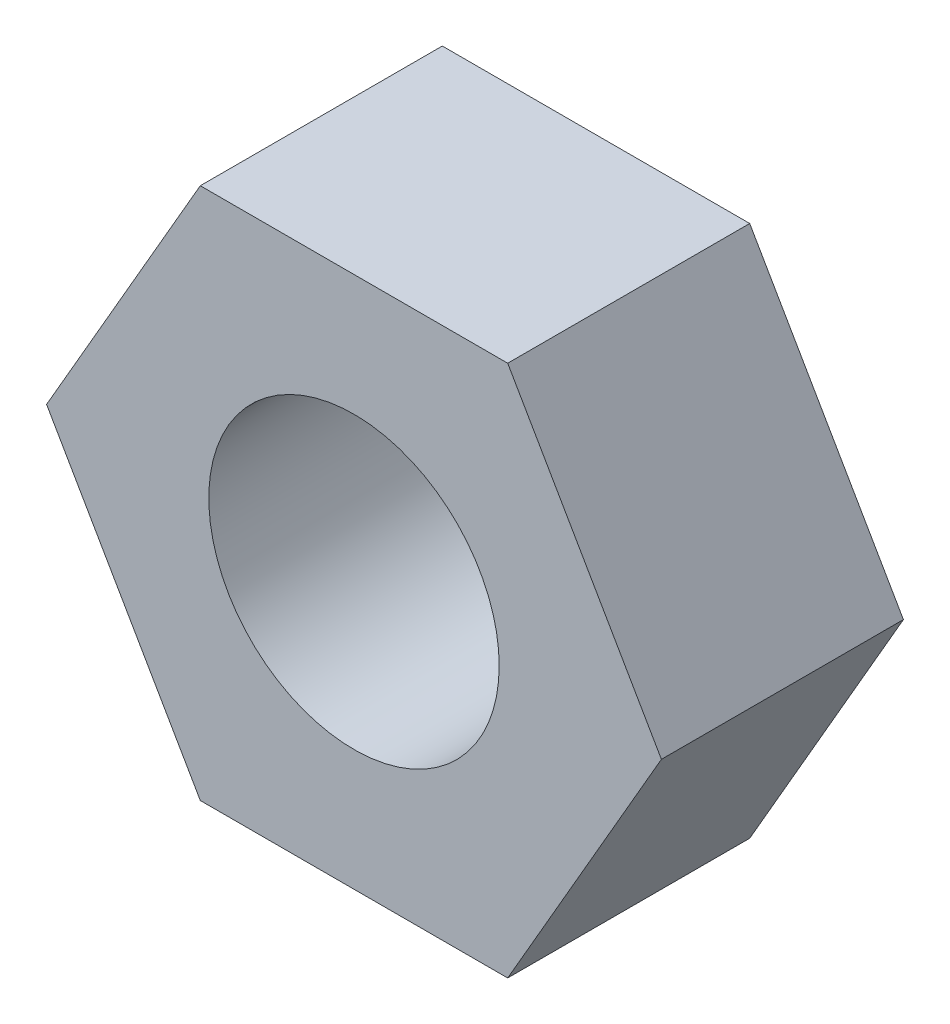
ISO-10303-21;
HEADER;
FILE_DESCRIPTION(('STEP AP214'),'2;1');
FILE_NAME('part.step','',(''),(''),'','','');
FILE_SCHEMA(('AUTOMOTIVE_DESIGN { 1 0 10303 214 1 1 1 1 }'));
ENDSEC;
DATA;
#1=APPLICATION_CONTEXT('core data for automotive mechanical design processes');
#2=APPLICATION_PROTOCOL_DEFINITION('international standard','automotive_design',2000,#1);
#3=PRODUCT_CONTEXT('',#1,'mechanical');
#4=PRODUCT('Part','Part','',(#3));
#5=PRODUCT_RELATED_PRODUCT_CATEGORY('part','',(#4));
#6=PRODUCT_DEFINITION_FORMATION('','',#4);
#7=PRODUCT_DEFINITION_CONTEXT('part definition',#1,'design');
#8=PRODUCT_DEFINITION('design','',#6,#7);
#9=PRODUCT_DEFINITION_SHAPE('','',#8);
#10=(LENGTH_UNIT() NAMED_UNIT(*) SI_UNIT(.MILLI.,.METRE.));
#11=(NAMED_UNIT(*) PLANE_ANGLE_UNIT() SI_UNIT($,.RADIAN.));
#12=(NAMED_UNIT(*) SI_UNIT($,.STERADIAN.) SOLID_ANGLE_UNIT());
#13=UNCERTAINTY_MEASURE_WITH_UNIT(LENGTH_MEASURE(1.E-05),#10,'distance_accuracy_value','');
#14=(GEOMETRIC_REPRESENTATION_CONTEXT(3) GLOBAL_UNCERTAINTY_ASSIGNED_CONTEXT((#13)) GLOBAL_UNIT_ASSIGNED_CONTEXT((#10,
#11,#12)) REPRESENTATION_CONTEXT('',''));
#15=CARTESIAN_POINT('',(0.,0.,0.));
#16=DIRECTION('',(0.,0.,1.));
#17=DIRECTION('',(1.,0.,0.));
#18=AXIS2_PLACEMENT_3D('',#15,#16,#17);
#19=CARTESIAN_POINT('',(3.17542648054294,0.,2.5));
#20=DIRECTION('',(-0.866025403784439,-0.5,0.));
#21=DIRECTION('',(0.5,-0.866025403784439,0.));
#22=AXIS2_PLACEMENT_3D('',#19,#20,#21);
#23=PLANE('',#22);
#24=DIRECTION('',(-0.5,0.866025403784438,0.));
#25=VECTOR('',#24,1.);
#26=CARTESIAN_POINT('',(3.17542648054294,0.,0.));
#27=LINE('',#26,#25);
#28=CARTESIAN_POINT('',(3.17542648054294,0.,0.));
#29=VERTEX_POINT('',#28);
#30=CARTESIAN_POINT('',(1.58771324027147,2.75,0.));
#31=VERTEX_POINT('',#30);
#32=EDGE_CURVE('E128',#29,#31,#27,.T.);
#33=ORIENTED_EDGE('',*,*,#32,.T.);
#34=DIRECTION('',(0.,0.,-1.));
#35=VECTOR('',#34,1.);
#36=CARTESIAN_POINT('',(1.58771324027147,2.75,2.5));
#37=LINE('',#36,#35);
#38=CARTESIAN_POINT('',(1.58771324027147,2.75,2.5));
#39=VERTEX_POINT('',#38);
#40=EDGE_CURVE('E11',#39,#31,#37,.T.);
#41=ORIENTED_EDGE('',*,*,#40,.F.);
#42=DIRECTION('',(-0.5,0.866025403784438,0.));
#43=VECTOR('',#42,1.);
#44=CARTESIAN_POINT('',(3.17542648054294,0.,2.5));
#45=LINE('',#44,#43);
#46=CARTESIAN_POINT('',(3.17542648054294,0.,2.5));
#47=VERTEX_POINT('',#46);
#48=EDGE_CURVE('E145',#47,#39,#45,.T.);
#49=ORIENTED_EDGE('',*,*,#48,.F.);
#50=DIRECTION('',(0.,0.,-1.));
#51=VECTOR('',#50,1.);
#52=CARTESIAN_POINT('',(3.17542648054294,0.,2.5));
#53=LINE('',#52,#51);
#54=EDGE_CURVE('E124',#47,#29,#53,.T.);
#55=ORIENTED_EDGE('',*,*,#54,.T.);
#56=EDGE_LOOP('',(#33,#41,#49,#55));
#57=FACE_BOUND('',#56,.T.);
#58=ADVANCED_FACE('F39',(#57),#23,.F.);
#59=CARTESIAN_POINT('',(1.58771324027147,2.75,2.5));
#60=DIRECTION('',(0.,-1.,0.));
#61=DIRECTION('',(1.,0.,0.));
#62=AXIS2_PLACEMENT_3D('',#59,#60,#61);
#63=PLANE('',#62);
#64=DIRECTION('',(-1.,0.,0.));
#65=VECTOR('',#64,1.);
#66=CARTESIAN_POINT('',(1.58771324027147,2.75,0.));
#67=LINE('',#66,#65);
#68=CARTESIAN_POINT('',(-1.58771324027147,2.75,0.));
#69=VERTEX_POINT('',#68);
#70=EDGE_CURVE('E132',#31,#69,#67,.T.);
#71=ORIENTED_EDGE('',*,*,#70,.T.);
#72=DIRECTION('',(0.,0.,-1.));
#73=VECTOR('',#72,1.);
#74=CARTESIAN_POINT('',(-1.58771324027147,2.75,2.5));
#75=LINE('',#74,#73);
#76=CARTESIAN_POINT('',(-1.58771324027147,2.75,2.5));
#77=VERTEX_POINT('',#76);
#78=EDGE_CURVE('E48',#77,#69,#75,.T.);
#79=ORIENTED_EDGE('',*,*,#78,.F.);
#80=DIRECTION('',(-1.,0.,0.));
#81=VECTOR('',#80,1.);
#82=CARTESIAN_POINT('',(1.58771324027147,2.75,2.5));
#83=LINE('',#82,#81);
#84=EDGE_CURVE('E93',#39,#77,#83,.T.);
#85=ORIENTED_EDGE('',*,*,#84,.F.);
#86=ORIENTED_EDGE('',*,*,#40,.T.);
#87=EDGE_LOOP('',(#71,#79,#85,#86));
#88=FACE_BOUND('',#87,.T.);
#89=ADVANCED_FACE('F174',(#88),#63,.F.);
#90=CARTESIAN_POINT('',(-1.58771324027147,2.75,2.5));
#91=DIRECTION('',(0.866025403784439,-0.5,0.));
#92=DIRECTION('',(0.5,0.866025403784439,0.));
#93=AXIS2_PLACEMENT_3D('',#90,#91,#92);
#94=PLANE('',#93);
#95=DIRECTION('',(-0.5,-0.866025403784439,0.));
#96=VECTOR('',#95,1.);
#97=CARTESIAN_POINT('',(-1.58771324027147,2.75,0.));
#98=LINE('',#97,#96);
#99=CARTESIAN_POINT('',(-3.17542648054294,0.,0.));
#100=VERTEX_POINT('',#99);
#101=EDGE_CURVE('E136',#69,#100,#98,.T.);
#102=ORIENTED_EDGE('',*,*,#101,.T.);
#103=DIRECTION('',(0.,0.,-1.));
#104=VECTOR('',#103,1.);
#105=CARTESIAN_POINT('',(-3.17542648054294,0.,2.5));
#106=LINE('',#105,#104);
#107=CARTESIAN_POINT('',(-3.17542648054294,0.,2.5));
#108=VERTEX_POINT('',#107);
#109=EDGE_CURVE('E117',#108,#100,#106,.T.);
#110=ORIENTED_EDGE('',*,*,#109,.F.);
#111=DIRECTION('',(-0.5,-0.866025403784439,0.));
#112=VECTOR('',#111,1.);
#113=CARTESIAN_POINT('',(-1.58771324027147,2.75,2.5));
#114=LINE('',#113,#112);
#115=EDGE_CURVE('E106',#77,#108,#114,.T.);
#116=ORIENTED_EDGE('',*,*,#115,.F.);
#117=ORIENTED_EDGE('',*,*,#78,.T.);
#118=EDGE_LOOP('',(#102,#110,#116,#117));
#119=FACE_BOUND('',#118,.T.);
#120=ADVANCED_FACE('F155',(#119),#94,.F.);
#121=CARTESIAN_POINT('',(-3.17542648054294,0.,2.5));
#122=DIRECTION('',(0.866025403784439,0.5,0.));
#123=DIRECTION('',(-0.5,0.866025403784439,0.));
#124=AXIS2_PLACEMENT_3D('',#121,#122,#123);
#125=PLANE('',#124);
#126=DIRECTION('',(0.5,-0.866025403784438,0.));
#127=VECTOR('',#126,1.);
#128=CARTESIAN_POINT('',(-3.17542648054294,0.,0.));
#129=LINE('',#128,#127);
#130=CARTESIAN_POINT('',(-1.58771324027147,-2.75,0.));
#131=VERTEX_POINT('',#130);
#132=EDGE_CURVE('E115',#100,#131,#129,.T.);
#133=ORIENTED_EDGE('',*,*,#132,.T.);
#134=DIRECTION('',(0.,0.,-1.));
#135=VECTOR('',#134,1.);
#136=CARTESIAN_POINT('',(-1.58771324027147,-2.75,2.5));
#137=LINE('',#136,#135);
#138=CARTESIAN_POINT('',(-1.58771324027147,-2.75,2.5));
#139=VERTEX_POINT('',#138);
#140=EDGE_CURVE('E112',#139,#131,#137,.T.);
#141=ORIENTED_EDGE('',*,*,#140,.F.);
#142=DIRECTION('',(0.5,-0.866025403784438,0.));
#143=VECTOR('',#142,1.);
#144=CARTESIAN_POINT('',(-3.17542648054294,0.,2.5));
#145=LINE('',#144,#143);
#146=EDGE_CURVE('E100',#108,#139,#145,.T.);
#147=ORIENTED_EDGE('',*,*,#146,.F.);
#148=ORIENTED_EDGE('',*,*,#109,.T.);
#149=EDGE_LOOP('',(#133,#141,#147,#148));
#150=FACE_BOUND('',#149,.T.);
#151=ADVANCED_FACE('F113',(#150),#125,.F.);
#152=CARTESIAN_POINT('',(-1.58771324027147,-2.75,2.5));
#153=DIRECTION('',(0.,1.,0.));
#154=DIRECTION('',(-1.,0.,0.));
#155=AXIS2_PLACEMENT_3D('',#152,#153,#154);
#156=PLANE('',#155);
#157=DIRECTION('',(1.,0.,0.));
#158=VECTOR('',#157,1.);
#159=CARTESIAN_POINT('',(-1.58771324027147,-2.75,0.));
#160=LINE('',#159,#158);
#161=CARTESIAN_POINT('',(1.58771324027147,-2.75,0.));
#162=VERTEX_POINT('',#161);
#163=EDGE_CURVE('E79',#131,#162,#160,.T.);
#164=ORIENTED_EDGE('',*,*,#163,.T.);
#165=DIRECTION('',(0.,0.,-1.));
#166=VECTOR('',#165,1.);
#167=CARTESIAN_POINT('',(1.58771324027147,-2.75,2.5));
#168=LINE('',#167,#166);
#169=CARTESIAN_POINT('',(1.58771324027147,-2.75,2.5));
#170=VERTEX_POINT('',#169);
#171=EDGE_CURVE('E118',#170,#162,#168,.T.);
#172=ORIENTED_EDGE('',*,*,#171,.F.);
#173=DIRECTION('',(1.,0.,0.));
#174=VECTOR('',#173,1.);
#175=CARTESIAN_POINT('',(-1.58771324027147,-2.75,2.5));
#176=LINE('',#175,#174);
#177=EDGE_CURVE('E104',#139,#170,#176,.T.);
#178=ORIENTED_EDGE('',*,*,#177,.F.);
#179=ORIENTED_EDGE('',*,*,#140,.T.);
#180=EDGE_LOOP('',(#164,#172,#178,#179));
#181=FACE_BOUND('',#180,.T.);
#182=ADVANCED_FACE('F120',(#181),#156,.F.);
#183=CARTESIAN_POINT('',(1.58771324027147,-2.75,2.5));
#184=DIRECTION('',(-0.866025403784439,0.5,0.));
#185=DIRECTION('',(-0.5,-0.866025403784439,0.));
#186=AXIS2_PLACEMENT_3D('',#183,#184,#185);
#187=PLANE('',#186);
#188=DIRECTION('',(0.5,0.866025403784439,0.));
#189=VECTOR('',#188,1.);
#190=CARTESIAN_POINT('',(1.58771324027147,-2.75,0.));
#191=LINE('',#190,#189);
#192=EDGE_CURVE('E85',#162,#29,#191,.T.);
#193=ORIENTED_EDGE('',*,*,#192,.T.);
#194=ORIENTED_EDGE('',*,*,#54,.F.);
#195=DIRECTION('',(0.5,0.866025403784439,0.));
#196=VECTOR('',#195,1.);
#197=CARTESIAN_POINT('',(1.58771324027147,-2.75,2.5));
#198=LINE('',#197,#196);
#199=EDGE_CURVE('E56',#170,#47,#198,.T.);
#200=ORIENTED_EDGE('',*,*,#199,.F.);
#201=ORIENTED_EDGE('',*,*,#171,.T.);
#202=EDGE_LOOP('',(#193,#194,#200,#201));
#203=FACE_BOUND('',#202,.T.);
#204=ADVANCED_FACE('F162',(#203),#187,.F.);
#205=CARTESIAN_POINT('',(0.,0.,2.5));
#206=DIRECTION('',(0.,0.,1.));
#207=DIRECTION('',(1.,0.,0.));
#208=AXIS2_PLACEMENT_3D('',#205,#206,#207);
#209=PLANE('',#208);
#210=CARTESIAN_POINT('',(0.,0.,2.5));
#211=DIRECTION('',(0.,0.,1.));
#212=DIRECTION('',(1.,0.,0.));
#213=AXIS2_PLACEMENT_3D('',#210,#211,#212);
#214=CIRCLE('',#213,1.5);
#215=CARTESIAN_POINT('',(1.5,0.,2.5));
#216=VERTEX_POINT('',#215);
#217=EDGE_CURVE('E229',#216,#216,#214,.T.);
#218=ORIENTED_EDGE('',*,*,#217,.F.);
#219=EDGE_LOOP('',(#218));
#220=FACE_BOUND('',#219,.T.);
#221=ORIENTED_EDGE('',*,*,#48,.T.);
#222=ORIENTED_EDGE('',*,*,#84,.T.);
#223=ORIENTED_EDGE('',*,*,#115,.T.);
#224=ORIENTED_EDGE('',*,*,#146,.T.);
#225=ORIENTED_EDGE('',*,*,#177,.T.);
#226=ORIENTED_EDGE('',*,*,#199,.T.);
#227=EDGE_LOOP('',(#221,#222,#223,#224,#225,#226));
#228=FACE_BOUND('',#227,.T.);
#229=ADVANCED_FACE('F102',(#220,#228),#209,.T.);
#230=CARTESIAN_POINT('',(0.,0.,0.));
#231=DIRECTION('',(0.,0.,1.));
#232=DIRECTION('',(1.,0.,0.));
#233=AXIS2_PLACEMENT_3D('',#230,#231,#232);
#234=PLANE('',#233);
#235=CARTESIAN_POINT('',(0.,0.,0.));
#236=DIRECTION('',(0.,0.,1.));
#237=DIRECTION('',(1.,0.,0.));
#238=AXIS2_PLACEMENT_3D('',#235,#236,#237);
#239=CIRCLE('',#238,1.5);
#240=CARTESIAN_POINT('',(1.5,0.,0.));
#241=VERTEX_POINT('',#240);
#242=EDGE_CURVE('E133',#241,#241,#239,.T.);
#243=ORIENTED_EDGE('',*,*,#242,.T.);
#244=EDGE_LOOP('',(#243));
#245=FACE_BOUND('',#244,.T.);
#246=ORIENTED_EDGE('',*,*,#32,.F.);
#247=ORIENTED_EDGE('',*,*,#192,.F.);
#248=ORIENTED_EDGE('',*,*,#163,.F.);
#249=ORIENTED_EDGE('',*,*,#132,.F.);
#250=ORIENTED_EDGE('',*,*,#101,.F.);
#251=ORIENTED_EDGE('',*,*,#70,.F.);
#252=EDGE_LOOP('',(#246,#247,#248,#249,#250,#251));
#253=FACE_BOUND('',#252,.T.);
#254=ADVANCED_FACE('F158',(#245,#253),#234,.F.);
#255=CARTESIAN_POINT('',(0.,0.,0.));
#256=DIRECTION('',(0.,0.,1.));
#257=DIRECTION('',(1.,0.,0.));
#258=AXIS2_PLACEMENT_3D('',#255,#256,#257);
#259=CYLINDRICAL_SURFACE('',#258,1.5);
#260=ORIENTED_EDGE('',*,*,#242,.F.);
#261=EDGE_LOOP('',(#260));
#262=FACE_BOUND('',#261,.T.);
#263=ORIENTED_EDGE('',*,*,#217,.T.);
#264=EDGE_LOOP('',(#263));
#265=FACE_BOUND('',#264,.T.);
#266=ADVANCED_FACE('F211',(#262,#265),#259,.F.);
#267=CLOSED_SHELL('',(#58,#89,#120,#151,#182,#204,#229,#254,#266));
#268=MANIFOLD_SOLID_BREP('B2',#267);
#269=ADVANCED_BREP_SHAPE_REPRESENTATION('',(#18,#268),#14);
#270=SHAPE_DEFINITION_REPRESENTATION(#9,#269);
ENDSEC;
END-ISO-10303-21;
